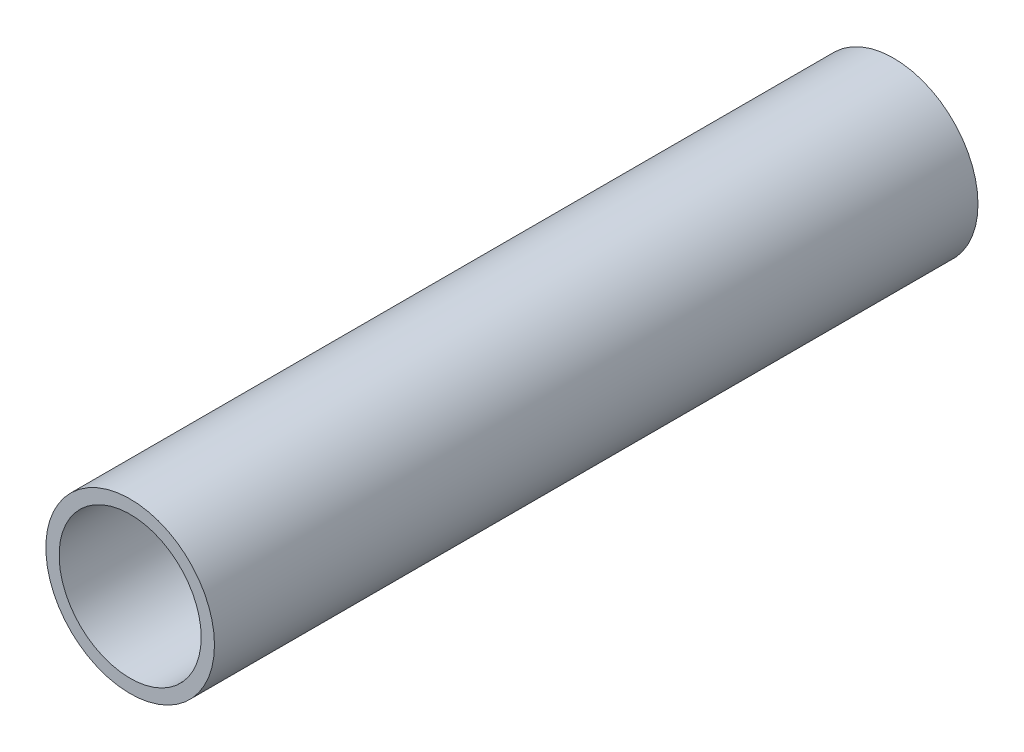
ISO-10303-21;
HEADER;
FILE_DESCRIPTION(('STEP AP214'),'2;1');
FILE_NAME('part.step','',(''),(''),'','','');
FILE_SCHEMA(('AUTOMOTIVE_DESIGN { 1 0 10303 214 1 1 1 1 }'));
ENDSEC;
DATA;
#1=APPLICATION_CONTEXT('core data for automotive mechanical design processes');
#2=APPLICATION_PROTOCOL_DEFINITION('international standard','automotive_design',2000,#1);
#3=PRODUCT_CONTEXT('',#1,'mechanical');
#4=PRODUCT('Part','Part','',(#3));
#5=PRODUCT_RELATED_PRODUCT_CATEGORY('part','',(#4));
#6=PRODUCT_DEFINITION_FORMATION('','',#4);
#7=PRODUCT_DEFINITION_CONTEXT('part definition',#1,'design');
#8=PRODUCT_DEFINITION('design','',#6,#7);
#9=PRODUCT_DEFINITION_SHAPE('','',#8);
#10=(LENGTH_UNIT() NAMED_UNIT(*) SI_UNIT(.MILLI.,.METRE.));
#11=(NAMED_UNIT(*) PLANE_ANGLE_UNIT() SI_UNIT($,.RADIAN.));
#12=(NAMED_UNIT(*) SI_UNIT($,.STERADIAN.) SOLID_ANGLE_UNIT());
#13=UNCERTAINTY_MEASURE_WITH_UNIT(LENGTH_MEASURE(1.E-05),#10,'distance_accuracy_value','');
#14=(GEOMETRIC_REPRESENTATION_CONTEXT(3) GLOBAL_UNCERTAINTY_ASSIGNED_CONTEXT((#13)) GLOBAL_UNIT_ASSIGNED_CONTEXT((#10,
#11,#12)) REPRESENTATION_CONTEXT('',''));
#15=CARTESIAN_POINT('',(0.,0.,0.));
#16=DIRECTION('',(0.,0.,1.));
#17=DIRECTION('',(1.,0.,0.));
#18=AXIS2_PLACEMENT_3D('',#15,#16,#17);
#19=CARTESIAN_POINT('',(0.,0.,-115.));
#20=DIRECTION('',(0.,0.,-1.));
#21=DIRECTION('',(1.,0.,0.));
#22=AXIS2_PLACEMENT_3D('',#19,#20,#21);
#23=PLANE('',#22);
#24=CARTESIAN_POINT('',(0.,0.,-115.));
#25=DIRECTION('',(0.,0.,1.));
#26=DIRECTION('',(1.,0.,0.));
#27=AXIS2_PLACEMENT_3D('',#24,#25,#26);
#28=CIRCLE('',#27,12.7);
#29=CARTESIAN_POINT('',(12.7,0.,-115.));
#30=VERTEX_POINT('',#29);
#31=EDGE_CURVE('E10',#30,#30,#28,.T.);
#32=ORIENTED_EDGE('',*,*,#31,.F.);
#33=EDGE_LOOP('',(#32));
#34=FACE_BOUND('',#33,.T.);
#35=CARTESIAN_POINT('',(0.,0.,-115.));
#36=DIRECTION('',(0.,0.,1.));
#37=DIRECTION('',(1.,0.,0.));
#38=AXIS2_PLACEMENT_3D('',#35,#36,#37);
#39=CIRCLE('',#38,10.7);
#40=CARTESIAN_POINT('',(10.7,0.,-115.));
#41=VERTEX_POINT('',#40);
#42=EDGE_CURVE('E48',#41,#41,#39,.T.);
#43=ORIENTED_EDGE('',*,*,#42,.T.);
#44=EDGE_LOOP('',(#43));
#45=FACE_BOUND('',#44,.T.);
#46=ADVANCED_FACE('F37',(#34,#45),#23,.T.);
#47=CARTESIAN_POINT('',(0.,0.,0.));
#48=DIRECTION('',(0.,0.,-1.));
#49=DIRECTION('',(1.,0.,0.));
#50=AXIS2_PLACEMENT_3D('',#47,#48,#49);
#51=PLANE('',#50);
#52=CARTESIAN_POINT('',(0.,0.,0.));
#53=DIRECTION('',(0.,0.,1.));
#54=DIRECTION('',(1.,0.,0.));
#55=AXIS2_PLACEMENT_3D('',#52,#53,#54);
#56=CIRCLE('',#55,12.7);
#57=CARTESIAN_POINT('',(12.7,0.,0.));
#58=VERTEX_POINT('',#57);
#59=EDGE_CURVE('E41',#58,#58,#56,.T.);
#60=ORIENTED_EDGE('',*,*,#59,.T.);
#61=EDGE_LOOP('',(#60));
#62=FACE_BOUND('',#61,.T.);
#63=CARTESIAN_POINT('',(0.,0.,0.));
#64=DIRECTION('',(0.,0.,1.));
#65=DIRECTION('',(1.,0.,0.));
#66=AXIS2_PLACEMENT_3D('',#63,#64,#65);
#67=CIRCLE('',#66,10.7);
#68=CARTESIAN_POINT('',(10.7,0.,0.));
#69=VERTEX_POINT('',#68);
#70=EDGE_CURVE('E50',#69,#69,#67,.T.);
#71=ORIENTED_EDGE('',*,*,#70,.F.);
#72=EDGE_LOOP('',(#71));
#73=FACE_BOUND('',#72,.T.);
#74=ADVANCED_FACE('F63',(#62,#73),#51,.F.);
#75=CARTESIAN_POINT('',(0.,0.,-115.));
#76=DIRECTION('',(0.,0.,1.));
#77=DIRECTION('',(-1.,0.,0.));
#78=AXIS2_PLACEMENT_3D('',#75,#76,#77);
#79=CYLINDRICAL_SURFACE('',#78,12.7);
#80=ORIENTED_EDGE('',*,*,#31,.T.);
#81=EDGE_LOOP('',(#80));
#82=FACE_BOUND('',#81,.T.);
#83=ORIENTED_EDGE('',*,*,#59,.F.);
#84=EDGE_LOOP('',(#83));
#85=FACE_BOUND('',#84,.T.);
#86=ADVANCED_FACE('F39',(#82,#85),#79,.T.);
#87=CARTESIAN_POINT('',(0.,0.,-115.));
#88=DIRECTION('',(0.,0.,1.));
#89=DIRECTION('',(-1.,0.,0.));
#90=AXIS2_PLACEMENT_3D('',#87,#88,#89);
#91=CYLINDRICAL_SURFACE('',#90,10.7);
#92=ORIENTED_EDGE('',*,*,#42,.F.);
#93=EDGE_LOOP('',(#92));
#94=FACE_BOUND('',#93,.T.);
#95=ORIENTED_EDGE('',*,*,#70,.T.);
#96=EDGE_LOOP('',(#95));
#97=FACE_BOUND('',#96,.T.);
#98=ADVANCED_FACE('F57',(#94,#97),#91,.F.);
#99=CLOSED_SHELL('',(#46,#74,#86,#98));
#100=MANIFOLD_SOLID_BREP('B2',#99);
#101=ADVANCED_BREP_SHAPE_REPRESENTATION('',(#18,#100),#14);
#102=SHAPE_DEFINITION_REPRESENTATION(#9,#101);
ENDSEC;
END-ISO-10303-21;
